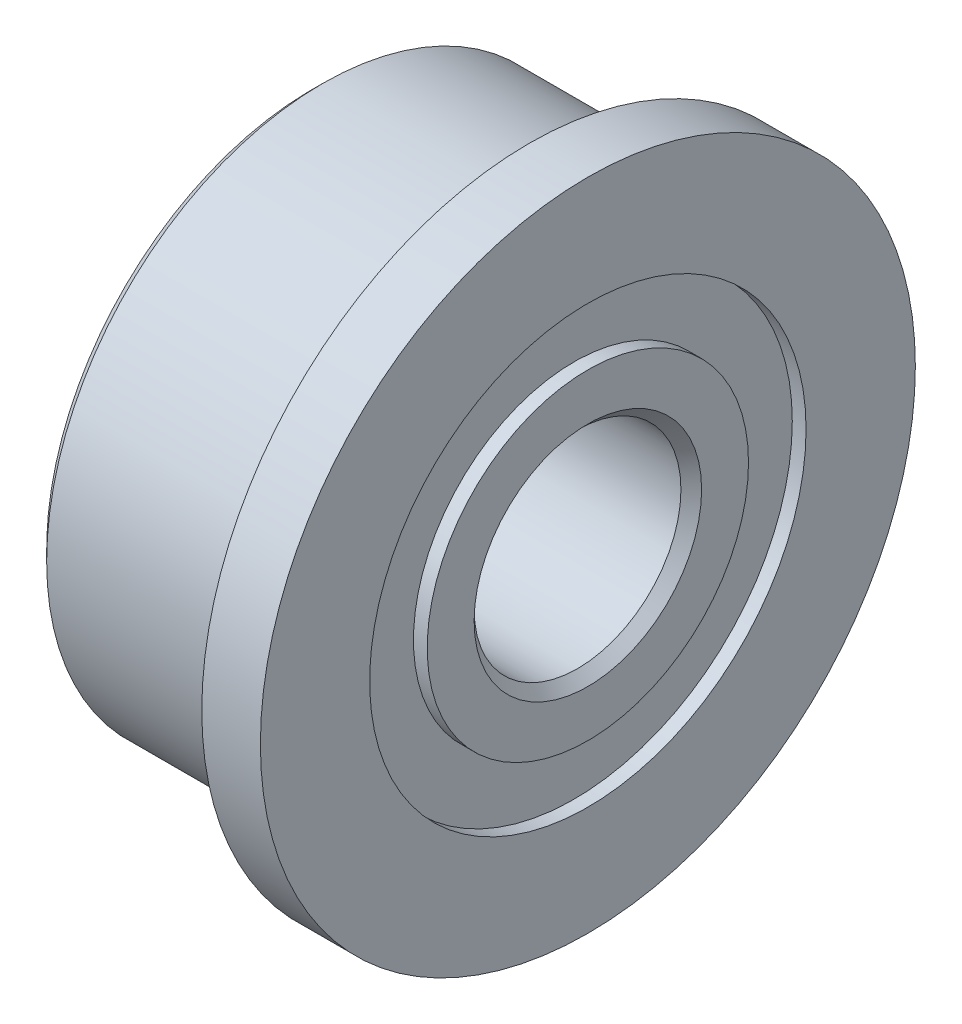
ISO-10303-21;
HEADER;
FILE_DESCRIPTION(('STEP AP214'),'2;1');
FILE_NAME('part.step','',(''),(''),'','','');
FILE_SCHEMA(('AUTOMOTIVE_DESIGN { 1 0 10303 214 1 1 1 1 }'));
ENDSEC;
DATA;
#1=APPLICATION_CONTEXT('core data for automotive mechanical design processes');
#2=APPLICATION_PROTOCOL_DEFINITION('international standard','automotive_design',2000,#1);
#3=PRODUCT_CONTEXT('',#1,'mechanical');
#4=PRODUCT('Part','Part','',(#3));
#5=PRODUCT_RELATED_PRODUCT_CATEGORY('part','',(#4));
#6=PRODUCT_DEFINITION_FORMATION('','',#4);
#7=PRODUCT_DEFINITION_CONTEXT('part definition',#1,'design');
#8=PRODUCT_DEFINITION('design','',#6,#7);
#9=PRODUCT_DEFINITION_SHAPE('','',#8);
#10=(LENGTH_UNIT() NAMED_UNIT(*) SI_UNIT(.MILLI.,.METRE.));
#11=(NAMED_UNIT(*) PLANE_ANGLE_UNIT() SI_UNIT($,.RADIAN.));
#12=(NAMED_UNIT(*) SI_UNIT($,.STERADIAN.) SOLID_ANGLE_UNIT());
#13=UNCERTAINTY_MEASURE_WITH_UNIT(LENGTH_MEASURE(1.E-05),#10,'distance_accuracy_value','');
#14=(GEOMETRIC_REPRESENTATION_CONTEXT(3) GLOBAL_UNCERTAINTY_ASSIGNED_CONTEXT((#13)) GLOBAL_UNIT_ASSIGNED_CONTEXT((#10,
#11,#12)) REPRESENTATION_CONTEXT('',''));
#15=CARTESIAN_POINT('',(0.,0.,0.));
#16=DIRECTION('',(0.,0.,1.));
#17=DIRECTION('',(1.,0.,0.));
#18=AXIS2_PLACEMENT_3D('',#15,#16,#17);
#19=CARTESIAN_POINT('',(-4.0000000000191,0.,0.));
#20=DIRECTION('',(1.,0.,0.));
#21=DIRECTION('',(0.,0.,-1.));
#22=AXIS2_PLACEMENT_3D('',#19,#20,#21);
#23=CYLINDRICAL_SURFACE('',#22,3.165);
#24=CARTESIAN_POINT('',(-3.8,0.,0.));
#25=DIRECTION('',(1.,0.,0.));
#26=DIRECTION('',(0.,0.,-1.));
#27=AXIS2_PLACEMENT_3D('',#24,#25,#26);
#28=CIRCLE('',#27,3.165);
#29=CARTESIAN_POINT('',(-3.8,0.,-3.165));
#30=VERTEX_POINT('',#29);
#31=EDGE_CURVE('E88',#30,#30,#28,.T.);
#32=ORIENTED_EDGE('',*,*,#31,.T.);
#33=EDGE_LOOP('',(#32));
#34=FACE_BOUND('',#33,.T.);
#35=CARTESIAN_POINT('',(-4.,0.,0.));
#36=DIRECTION('',(1.,0.,0.));
#37=DIRECTION('',(0.,0.,-1.));
#38=AXIS2_PLACEMENT_3D('',#35,#36,#37);
#39=CIRCLE('',#38,3.165);
#40=CARTESIAN_POINT('',(-4.,0.,-3.165));
#41=VERTEX_POINT('',#40);
#42=EDGE_CURVE('E10',#41,#41,#39,.T.);
#43=ORIENTED_EDGE('',*,*,#42,.F.);
#44=EDGE_LOOP('',(#43));
#45=FACE_BOUND('',#44,.T.);
#46=ADVANCED_FACE('F30',(#34,#45),#23,.F.);
#47=CARTESIAN_POINT('',(-4.,3.84999999994307,0.));
#48=DIRECTION('',(-1.,0.,0.));
#49=DIRECTION('',(0.,0.,1.));
#50=AXIS2_PLACEMENT_3D('',#47,#48,#49);
#51=PLANE('',#50);
#52=ORIENTED_EDGE('',*,*,#42,.T.);
#53=EDGE_LOOP('',(#52));
#54=FACE_BOUND('',#53,.T.);
#55=CARTESIAN_POINT('',(-4.,0.,0.));
#56=DIRECTION('',(1.,0.,0.));
#57=DIRECTION('',(0.,0.,-1.));
#58=AXIS2_PLACEMENT_3D('',#55,#56,#57);
#59=CIRCLE('',#58,3.84999999994307);
#60=CARTESIAN_POINT('',(-4.,0.,-3.84999999994307));
#61=VERTEX_POINT('',#60);
#62=EDGE_CURVE('E36',#61,#61,#59,.T.);
#63=ORIENTED_EDGE('',*,*,#62,.F.);
#64=EDGE_LOOP('',(#63));
#65=FACE_BOUND('',#64,.T.);
#66=ADVANCED_FACE('F106',(#54,#65),#51,.T.);
#67=CARTESIAN_POINT('',(-3.84999999996199,0.,0.));
#68=DIRECTION('',(1.,0.,0.));
#69=DIRECTION('',(0.,0.,-1.));
#70=AXIS2_PLACEMENT_3D('',#67,#68,#69);
#71=CONICAL_SURFACE('',#70,3.99999999998108,0.785398163397447);
#72=ORIENTED_EDGE('',*,*,#62,.T.);
#73=EDGE_LOOP('',(#72));
#74=FACE_BOUND('',#73,.T.);
#75=CARTESIAN_POINT('',(-3.84999999996199,0.,0.));
#76=DIRECTION('',(1.,0.,0.));
#77=DIRECTION('',(0.,0.,-1.));
#78=AXIS2_PLACEMENT_3D('',#75,#76,#77);
#79=CIRCLE('',#78,3.99999999998108);
#80=CARTESIAN_POINT('',(-3.84999999996199,0.,-3.99999999998108));
#81=VERTEX_POINT('',#80);
#82=EDGE_CURVE('E40',#81,#81,#79,.T.);
#83=ORIENTED_EDGE('',*,*,#82,.F.);
#84=EDGE_LOOP('',(#83));
#85=FACE_BOUND('',#84,.T.);
#86=ADVANCED_FACE('F110',(#74,#85),#71,.T.);
#87=CARTESIAN_POINT('',(-4.0000000000191,0.,0.));
#88=DIRECTION('',(1.,0.,0.));
#89=DIRECTION('',(0.,0.,-1.));
#90=AXIS2_PLACEMENT_3D('',#87,#88,#89);
#91=CYLINDRICAL_SURFACE('',#90,3.99999999998108);
#92=ORIENTED_EDGE('',*,*,#82,.T.);
#93=EDGE_LOOP('',(#92));
#94=FACE_BOUND('',#93,.T.);
#95=CARTESIAN_POINT('',(-0.869999999961982,0.,0.));
#96=DIRECTION('',(1.,0.,0.));
#97=DIRECTION('',(0.,0.,-1.));
#98=AXIS2_PLACEMENT_3D('',#95,#96,#97);
#99=CIRCLE('',#98,3.99999999998108);
#100=CARTESIAN_POINT('',(-0.869999999961982,0.,-3.99999999998108));
#101=VERTEX_POINT('',#100);
#102=EDGE_CURVE('E44',#101,#101,#99,.T.);
#103=ORIENTED_EDGE('',*,*,#102,.F.);
#104=EDGE_LOOP('',(#103));
#105=FACE_BOUND('',#104,.T.);
#106=ADVANCED_FACE('F114',(#94,#105),#91,.T.);
#107=CARTESIAN_POINT('',(-0.849999999961982,0.,0.));
#108=DIRECTION('',(1.,0.,0.));
#109=DIRECTION('',(0.,0.,-1.));
#110=AXIS2_PLACEMENT_3D('',#107,#108,#109);
#111=TOROIDAL_SURFACE('',#110,3.99999999998108,0.0200000000000001);
#112=ORIENTED_EDGE('',*,*,#102,.T.);
#113=EDGE_LOOP('',(#112));
#114=FACE_BOUND('',#113,.T.);
#115=CARTESIAN_POINT('',(-0.849999999961982,0.,0.));
#116=DIRECTION('',(1.,0.,0.));
#117=DIRECTION('',(0.,0.,-1.));
#118=AXIS2_PLACEMENT_3D('',#115,#116,#117);
#119=CIRCLE('',#118,4.01999999998108);
#120=CARTESIAN_POINT('',(-0.849999999961982,0.,-4.01999999998108));
#121=VERTEX_POINT('',#120);
#122=EDGE_CURVE('E49',#121,#121,#119,.T.);
#123=ORIENTED_EDGE('',*,*,#122,.F.);
#124=EDGE_LOOP('',(#123));
#125=FACE_BOUND('',#124,.T.);
#126=ADVANCED_FACE('F120',(#114,#125),#111,.F.);
#127=CARTESIAN_POINT('',(-0.849999999961982,4.74999999998108,0.));
#128=DIRECTION('',(-1.,0.,0.));
#129=DIRECTION('',(0.,0.,1.));
#130=AXIS2_PLACEMENT_3D('',#127,#128,#129);
#131=PLANE('',#130);
#132=ORIENTED_EDGE('',*,*,#122,.T.);
#133=EDGE_LOOP('',(#132));
#134=FACE_BOUND('',#133,.T.);
#135=CARTESIAN_POINT('',(-0.849999999961982,0.,0.));
#136=DIRECTION('',(1.,0.,0.));
#137=DIRECTION('',(0.,0.,-1.));
#138=AXIS2_PLACEMENT_3D('',#135,#136,#137);
#139=CIRCLE('',#138,4.74999999998108);
#140=CARTESIAN_POINT('',(-0.849999999961982,0.,-4.74999999998108));
#141=VERTEX_POINT('',#140);
#142=EDGE_CURVE('E52',#141,#141,#139,.T.);
#143=ORIENTED_EDGE('',*,*,#142,.F.);
#144=EDGE_LOOP('',(#143));
#145=FACE_BOUND('',#144,.T.);
#146=ADVANCED_FACE('F124',(#134,#145),#131,.T.);
#147=CARTESIAN_POINT('',(-4.0000000000191,0.,0.));
#148=DIRECTION('',(1.,0.,0.));
#149=DIRECTION('',(0.,0.,-1.));
#150=AXIS2_PLACEMENT_3D('',#147,#148,#149);
#151=CYLINDRICAL_SURFACE('',#150,4.74999999998108);
#152=ORIENTED_EDGE('',*,*,#142,.T.);
#153=EDGE_LOOP('',(#152));
#154=FACE_BOUND('',#153,.T.);
#155=CARTESIAN_POINT('',(-2.70131139679108E-11,0.,0.));
#156=DIRECTION('',(1.,0.,0.));
#157=DIRECTION('',(0.,0.,-1.));
#158=AXIS2_PLACEMENT_3D('',#155,#156,#157);
#159=CIRCLE('',#158,4.74999999998108);
#160=CARTESIAN_POINT('',(-2.70131139679108E-11,0.,-4.74999999998108));
#161=VERTEX_POINT('',#160);
#162=EDGE_CURVE('E55',#161,#161,#159,.T.);
#163=ORIENTED_EDGE('',*,*,#162,.F.);
#164=EDGE_LOOP('',(#163));
#165=FACE_BOUND('',#164,.T.);
#166=ADVANCED_FACE('F128',(#154,#165),#151,.T.);
#167=CARTESIAN_POINT('',(-2.70127042831342E-11,3.165,0.));
#168=DIRECTION('',(1.,0.,0.));
#169=DIRECTION('',(0.,0.,-1.));
#170=AXIS2_PLACEMENT_3D('',#167,#168,#169);
#171=PLANE('',#170);
#172=ORIENTED_EDGE('',*,*,#162,.T.);
#173=EDGE_LOOP('',(#172));
#174=FACE_BOUND('',#173,.T.);
#175=CARTESIAN_POINT('',(-2.70131139679108E-11,0.,0.));
#176=DIRECTION('',(1.,0.,0.));
#177=DIRECTION('',(0.,0.,-1.));
#178=AXIS2_PLACEMENT_3D('',#175,#176,#177);
#179=CIRCLE('',#178,3.165);
#180=CARTESIAN_POINT('',(-2.70131139679108E-11,0.,-3.165));
#181=VERTEX_POINT('',#180);
#182=EDGE_CURVE('E58',#181,#181,#179,.T.);
#183=ORIENTED_EDGE('',*,*,#182,.F.);
#184=EDGE_LOOP('',(#183));
#185=FACE_BOUND('',#184,.T.);
#186=ADVANCED_FACE('F132',(#174,#185),#171,.T.);
#187=CARTESIAN_POINT('',(-4.0000000000191,0.,0.));
#188=DIRECTION('',(1.,0.,0.));
#189=DIRECTION('',(0.,0.,-1.));
#190=AXIS2_PLACEMENT_3D('',#187,#188,#189);
#191=CYLINDRICAL_SURFACE('',#190,3.165);
#192=ORIENTED_EDGE('',*,*,#182,.T.);
#193=EDGE_LOOP('',(#192));
#194=FACE_BOUND('',#193,.T.);
#195=CARTESIAN_POINT('',(-0.2,0.,0.));
#196=DIRECTION('',(1.,0.,0.));
#197=DIRECTION('',(0.,0.,-1.));
#198=AXIS2_PLACEMENT_3D('',#195,#196,#197);
#199=CIRCLE('',#198,3.165);
#200=CARTESIAN_POINT('',(-0.2,0.,-3.165));
#201=VERTEX_POINT('',#200);
#202=EDGE_CURVE('E61',#201,#201,#199,.T.);
#203=ORIENTED_EDGE('',*,*,#202,.F.);
#204=EDGE_LOOP('',(#203));
#205=FACE_BOUND('',#204,.T.);
#206=ADVANCED_FACE('F136',(#194,#205),#191,.F.);
#207=CARTESIAN_POINT('',(-0.2,2.33,0.));
#208=DIRECTION('',(1.,0.,0.));
#209=DIRECTION('',(0.,0.,-1.));
#210=AXIS2_PLACEMENT_3D('',#207,#208,#209);
#211=PLANE('',#210);
#212=ORIENTED_EDGE('',*,*,#202,.T.);
#213=EDGE_LOOP('',(#212));
#214=FACE_BOUND('',#213,.T.);
#215=CARTESIAN_POINT('',(-0.2,0.,0.));
#216=DIRECTION('',(1.,0.,0.));
#217=DIRECTION('',(0.,0.,-1.));
#218=AXIS2_PLACEMENT_3D('',#215,#216,#217);
#219=CIRCLE('',#218,2.33);
#220=CARTESIAN_POINT('',(-0.2,0.,-2.33));
#221=VERTEX_POINT('',#220);
#222=EDGE_CURVE('E64',#221,#221,#219,.T.);
#223=ORIENTED_EDGE('',*,*,#222,.F.);
#224=EDGE_LOOP('',(#223));
#225=FACE_BOUND('',#224,.T.);
#226=ADVANCED_FACE('F140',(#214,#225),#211,.T.);
#227=CARTESIAN_POINT('',(-4.0000000000191,0.,0.));
#228=DIRECTION('',(1.,0.,0.));
#229=DIRECTION('',(0.,0.,-1.));
#230=AXIS2_PLACEMENT_3D('',#227,#228,#229);
#231=CYLINDRICAL_SURFACE('',#230,2.33);
#232=ORIENTED_EDGE('',*,*,#222,.T.);
#233=EDGE_LOOP('',(#232));
#234=FACE_BOUND('',#233,.T.);
#235=CARTESIAN_POINT('',(-2.70131139679108E-11,0.,0.));
#236=DIRECTION('',(1.,0.,0.));
#237=DIRECTION('',(0.,0.,-1.));
#238=AXIS2_PLACEMENT_3D('',#235,#236,#237);
#239=CIRCLE('',#238,2.33);
#240=CARTESIAN_POINT('',(-2.70131139679108E-11,0.,-2.33));
#241=VERTEX_POINT('',#240);
#242=EDGE_CURVE('E67',#241,#241,#239,.T.);
#243=ORIENTED_EDGE('',*,*,#242,.F.);
#244=EDGE_LOOP('',(#243));
#245=FACE_BOUND('',#244,.T.);
#246=ADVANCED_FACE('F144',(#234,#245),#231,.T.);
#247=CARTESIAN_POINT('',(-2.70127011741723E-11,1.64999999998372,0.));
#248=DIRECTION('',(1.,0.,0.));
#249=DIRECTION('',(0.,0.,-1.));
#250=AXIS2_PLACEMENT_3D('',#247,#248,#249);
#251=PLANE('',#250);
#252=ORIENTED_EDGE('',*,*,#242,.T.);
#253=EDGE_LOOP('',(#252));
#254=FACE_BOUND('',#253,.T.);
#255=CARTESIAN_POINT('',(-2.70131139679108E-11,0.,0.));
#256=DIRECTION('',(1.,0.,0.));
#257=DIRECTION('',(0.,0.,-1.));
#258=AXIS2_PLACEMENT_3D('',#255,#256,#257);
#259=CIRCLE('',#258,1.64999999998372);
#260=CARTESIAN_POINT('',(-2.70131139679108E-11,0.,-1.64999999998372));
#261=VERTEX_POINT('',#260);
#262=EDGE_CURVE('E70',#261,#261,#259,.T.);
#263=ORIENTED_EDGE('',*,*,#262,.F.);
#264=EDGE_LOOP('',(#263));
#265=FACE_BOUND('',#264,.T.);
#266=ADVANCED_FACE('F148',(#254,#265),#251,.T.);
#267=CARTESIAN_POINT('',(-0.150000000074624,0.,0.));
#268=DIRECTION('',(1.,0.,0.));
#269=DIRECTION('',(0.,0.,-1.));
#270=AXIS2_PLACEMENT_3D('',#267,#268,#269);
#271=CONICAL_SURFACE('',#270,1.49999999998231,0.785398163243447);
#272=ORIENTED_EDGE('',*,*,#262,.T.);
#273=EDGE_LOOP('',(#272));
#274=FACE_BOUND('',#273,.T.);
#275=CARTESIAN_POINT('',(-0.150000000074624,0.,0.));
#276=DIRECTION('',(1.,0.,0.));
#277=DIRECTION('',(0.,0.,-1.));
#278=AXIS2_PLACEMENT_3D('',#275,#276,#277);
#279=CIRCLE('',#278,1.49999999998231);
#280=CARTESIAN_POINT('',(-0.150000000074624,0.,-1.49999999998231));
#281=VERTEX_POINT('',#280);
#282=EDGE_CURVE('E73',#281,#281,#279,.T.);
#283=ORIENTED_EDGE('',*,*,#282,.F.);
#284=EDGE_LOOP('',(#283));
#285=FACE_BOUND('',#284,.T.);
#286=ADVANCED_FACE('F152',(#274,#285),#271,.F.);
#287=CARTESIAN_POINT('',(-4.0000000000191,0.,0.));
#288=DIRECTION('',(1.,0.,0.));
#289=DIRECTION('',(0.,0.,-1.));
#290=AXIS2_PLACEMENT_3D('',#287,#288,#289);
#291=CYLINDRICAL_SURFACE('',#290,1.49999999998231);
#292=ORIENTED_EDGE('',*,*,#282,.T.);
#293=EDGE_LOOP('',(#292));
#294=FACE_BOUND('',#293,.T.);
#295=CARTESIAN_POINT('',(-3.84999999999859,0.,0.));
#296=DIRECTION('',(1.,0.,0.));
#297=DIRECTION('',(0.,0.,-1.));
#298=AXIS2_PLACEMENT_3D('',#295,#296,#297);
#299=CIRCLE('',#298,1.49999999998231);
#300=CARTESIAN_POINT('',(-3.84999999999859,0.,-1.49999999998231));
#301=VERTEX_POINT('',#300);
#302=EDGE_CURVE('E76',#301,#301,#299,.T.);
#303=ORIENTED_EDGE('',*,*,#302,.F.);
#304=EDGE_LOOP('',(#303));
#305=FACE_BOUND('',#304,.T.);
#306=ADVANCED_FACE('F156',(#294,#305),#291,.F.);
#307=CARTESIAN_POINT('',(-4.,0.,0.));
#308=DIRECTION('',(-1.,0.,0.));
#309=DIRECTION('',(0.,0.,1.));
#310=AXIS2_PLACEMENT_3D('',#307,#308,#309);
#311=CONICAL_SURFACE('',#310,1.64999999998372,0.785398163397448);
#312=ORIENTED_EDGE('',*,*,#302,.T.);
#313=EDGE_LOOP('',(#312));
#314=FACE_BOUND('',#313,.T.);
#315=CARTESIAN_POINT('',(-4.,0.,0.));
#316=DIRECTION('',(1.,0.,0.));
#317=DIRECTION('',(0.,0.,-1.));
#318=AXIS2_PLACEMENT_3D('',#315,#316,#317);
#319=CIRCLE('',#318,1.64999999998372);
#320=CARTESIAN_POINT('',(-4.,0.,-1.64999999998372));
#321=VERTEX_POINT('',#320);
#322=EDGE_CURVE('E79',#321,#321,#319,.T.);
#323=ORIENTED_EDGE('',*,*,#322,.F.);
#324=EDGE_LOOP('',(#323));
#325=FACE_BOUND('',#324,.T.);
#326=ADVANCED_FACE('F160',(#314,#325),#311,.F.);
#327=CARTESIAN_POINT('',(-4.,2.33,0.));
#328=DIRECTION('',(-1.,0.,0.));
#329=DIRECTION('',(0.,0.,1.));
#330=AXIS2_PLACEMENT_3D('',#327,#328,#329);
#331=PLANE('',#330);
#332=ORIENTED_EDGE('',*,*,#322,.T.);
#333=EDGE_LOOP('',(#332));
#334=FACE_BOUND('',#333,.T.);
#335=CARTESIAN_POINT('',(-4.,0.,0.));
#336=DIRECTION('',(1.,0.,0.));
#337=DIRECTION('',(0.,0.,-1.));
#338=AXIS2_PLACEMENT_3D('',#335,#336,#337);
#339=CIRCLE('',#338,2.33);
#340=CARTESIAN_POINT('',(-4.,0.,-2.33));
#341=VERTEX_POINT('',#340);
#342=EDGE_CURVE('E82',#341,#341,#339,.T.);
#343=ORIENTED_EDGE('',*,*,#342,.F.);
#344=EDGE_LOOP('',(#343));
#345=FACE_BOUND('',#344,.T.);
#346=ADVANCED_FACE('F102',(#334,#345),#331,.T.);
#347=CARTESIAN_POINT('',(-4.0000000000191,0.,0.));
#348=DIRECTION('',(1.,0.,0.));
#349=DIRECTION('',(0.,0.,-1.));
#350=AXIS2_PLACEMENT_3D('',#347,#348,#349);
#351=CYLINDRICAL_SURFACE('',#350,2.33);
#352=ORIENTED_EDGE('',*,*,#342,.T.);
#353=EDGE_LOOP('',(#352));
#354=FACE_BOUND('',#353,.T.);
#355=CARTESIAN_POINT('',(-3.8,0.,0.));
#356=DIRECTION('',(1.,0.,0.));
#357=DIRECTION('',(0.,0.,-1.));
#358=AXIS2_PLACEMENT_3D('',#355,#356,#357);
#359=CIRCLE('',#358,2.33);
#360=CARTESIAN_POINT('',(-3.8,0.,-2.33));
#361=VERTEX_POINT('',#360);
#362=EDGE_CURVE('E85',#361,#361,#359,.T.);
#363=ORIENTED_EDGE('',*,*,#362,.F.);
#364=EDGE_LOOP('',(#363));
#365=FACE_BOUND('',#364,.T.);
#366=ADVANCED_FACE('F96',(#354,#365),#351,.T.);
#367=CARTESIAN_POINT('',(-3.8,3.165,0.));
#368=DIRECTION('',(-1.,0.,0.));
#369=DIRECTION('',(0.,0.,1.));
#370=AXIS2_PLACEMENT_3D('',#367,#368,#369);
#371=PLANE('',#370);
#372=ORIENTED_EDGE('',*,*,#362,.T.);
#373=EDGE_LOOP('',(#372));
#374=FACE_BOUND('',#373,.T.);
#375=ORIENTED_EDGE('',*,*,#31,.F.);
#376=EDGE_LOOP('',(#375));
#377=FACE_BOUND('',#376,.T.);
#378=ADVANCED_FACE('F94',(#374,#377),#371,.T.);
#379=CLOSED_SHELL('',(#46,#66,#86,#106,#126,#146,#166,#186,#206,#226,#246,#266,#286,#306,#326,
#346,#366,#378));
#380=MANIFOLD_SOLID_BREP('B2',#379);
#381=ADVANCED_BREP_SHAPE_REPRESENTATION('',(#18,#380),#14);
#382=SHAPE_DEFINITION_REPRESENTATION(#9,#381);
ENDSEC;
END-ISO-10303-21;
